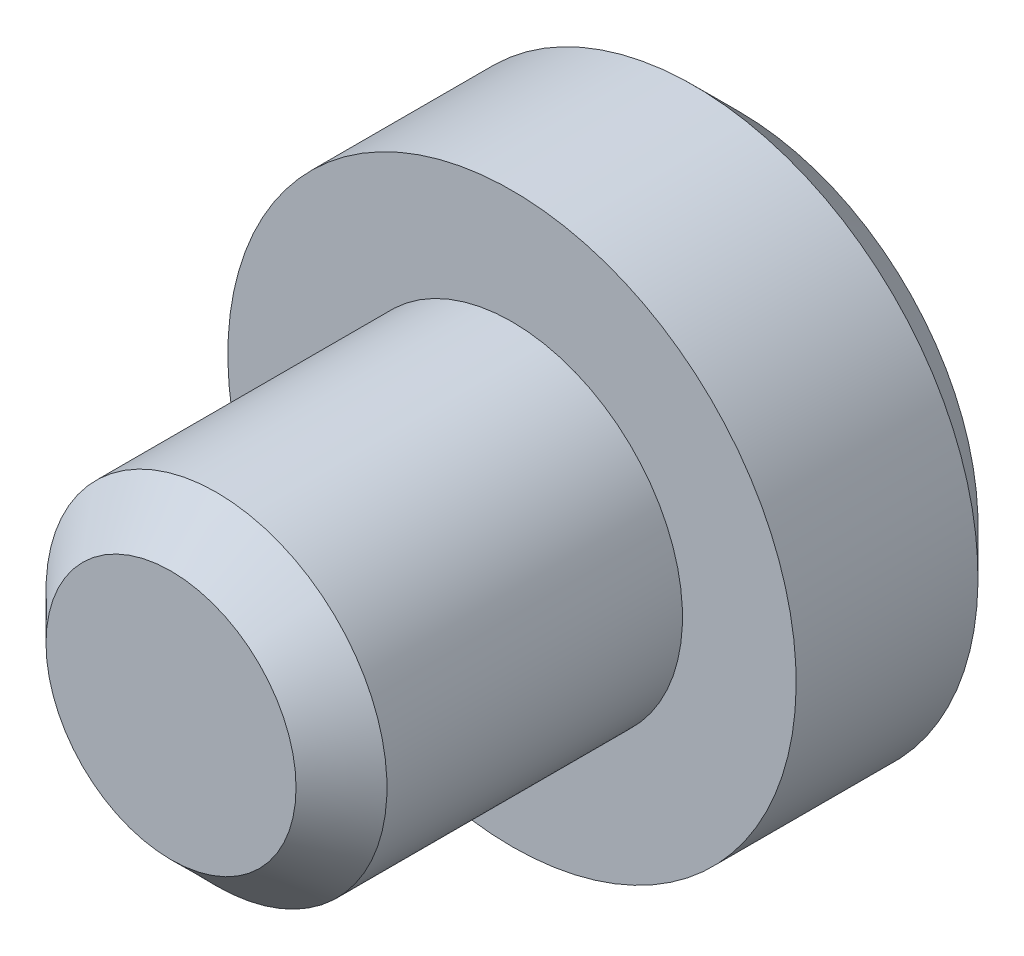
ISO-10303-21;
HEADER;
FILE_DESCRIPTION(('STEP AP214'),'2;1');
FILE_NAME('part.step','',(''),(''),'','','');
FILE_SCHEMA(('AUTOMOTIVE_DESIGN { 1 0 10303 214 1 1 1 1 }'));
ENDSEC;
DATA;
#1=APPLICATION_CONTEXT('core data for automotive mechanical design processes');
#2=APPLICATION_PROTOCOL_DEFINITION('international standard','automotive_design',2000,#1);
#3=PRODUCT_CONTEXT('',#1,'mechanical');
#4=PRODUCT('Part','Part','',(#3));
#5=PRODUCT_RELATED_PRODUCT_CATEGORY('part','',(#4));
#6=PRODUCT_DEFINITION_FORMATION('','',#4);
#7=PRODUCT_DEFINITION_CONTEXT('part definition',#1,'design');
#8=PRODUCT_DEFINITION('design','',#6,#7);
#9=PRODUCT_DEFINITION_SHAPE('','',#8);
#10=(LENGTH_UNIT() NAMED_UNIT(*) SI_UNIT(.MILLI.,.METRE.));
#11=(NAMED_UNIT(*) PLANE_ANGLE_UNIT() SI_UNIT($,.RADIAN.));
#12=(NAMED_UNIT(*) SI_UNIT($,.STERADIAN.) SOLID_ANGLE_UNIT());
#13=UNCERTAINTY_MEASURE_WITH_UNIT(LENGTH_MEASURE(1.E-05),#10,'distance_accuracy_value','');
#14=(GEOMETRIC_REPRESENTATION_CONTEXT(3) GLOBAL_UNCERTAINTY_ASSIGNED_CONTEXT((#13)) GLOBAL_UNIT_ASSIGNED_CONTEXT((#10,
#11,#12)) REPRESENTATION_CONTEXT('',''));
#15=CARTESIAN_POINT('',(0.,0.,0.));
#16=DIRECTION('',(0.,0.,1.));
#17=DIRECTION('',(1.,0.,0.));
#18=AXIS2_PLACEMENT_3D('',#15,#16,#17);
#19=CARTESIAN_POINT('',(0.,0.,0.));
#20=DIRECTION('',(0.,0.,0.999999999999999));
#21=DIRECTION('',(0.,-1.,0.));
#22=AXIS2_PLACEMENT_3D('',#19,#20,#21);
#23=PLANE('',#22);
#24=DIRECTION('',(0.799545155725773,-0.600605980619118,0.));
#25=VECTOR('',#24,1.);
#26=CARTESIAN_POINT('',(-0.720727176742916,-0.959454186870934,0.));
#27=LINE('',#26,#25);
#28=CARTESIAN_POINT('',(-1.27466830980796,-0.543342157366178,0.));
#29=VERTEX_POINT('',#28);
#30=CARTESIAN_POINT('',(-0.166786043677938,-1.37556621637569,0.));
#31=VERTEX_POINT('',#30);
#32=EDGE_CURVE('E182',#29,#31,#27,.T.);
#33=ORIENTED_EDGE('',*,*,#32,.T.);
#34=DIRECTION('',(0.919912614743907,0.392123426021746,0.));
#35=VECTOR('',#34,1.);
#36=CARTESIAN_POINT('',(0.470548111226016,-1.10389513769277,0.));
#37=LINE('',#36,#35);
#38=CARTESIAN_POINT('',(1.10788226613005,-0.832224059009568,0.));
#39=VERTEX_POINT('',#38);
#40=EDGE_CURVE('E192',#31,#39,#37,.T.);
#41=ORIENTED_EDGE('',*,*,#40,.T.);
#42=DIRECTION('',(0.120367459018134,0.992729406640863,0.));
#43=VECTOR('',#42,1.);
#44=CARTESIAN_POINT('',(1.19127528796908,-0.144440950821778,0.));
#45=LINE('',#44,#43);
#46=CARTESIAN_POINT('',(1.27466830980796,0.543342157366122,0.));
#47=VERTEX_POINT('',#46);
#48=EDGE_CURVE('E190',#39,#47,#45,.T.);
#49=ORIENTED_EDGE('',*,*,#48,.T.);
#50=DIRECTION('',(-0.799545155725773,0.600605980619118,0.));
#51=VECTOR('',#50,1.);
#52=CARTESIAN_POINT('',(0.720727176742986,0.959454186870934,0.));
#53=LINE('',#52,#51);
#54=CARTESIAN_POINT('',(0.166786043677966,1.37556621637577,0.));
#55=VERTEX_POINT('',#54);
#56=EDGE_CURVE('E188',#47,#55,#53,.T.);
#57=ORIENTED_EDGE('',*,*,#56,.T.);
#58=DIRECTION('',(-0.919912614743907,-0.392123426021745,0.));
#59=VECTOR('',#58,1.);
#60=CARTESIAN_POINT('',(-0.470548111226127,1.1038951376928,0.));
#61=LINE('',#60,#59);
#62=CARTESIAN_POINT('',(-1.10788226613005,0.832224059009623,0.));
#63=VERTEX_POINT('',#62);
#64=EDGE_CURVE('E186',#55,#63,#61,.T.);
#65=ORIENTED_EDGE('',*,*,#64,.T.);
#66=DIRECTION('',(-0.120367459018134,-0.992729406640863,0.));
#67=VECTOR('',#66,1.);
#68=CARTESIAN_POINT('',(-1.19127528796906,0.144440950821723,0.));
#69=LINE('',#68,#67);
#70=EDGE_CURVE('E184',#63,#29,#69,.T.);
#71=ORIENTED_EDGE('',*,*,#70,.T.);
#72=EDGE_LOOP('',(#33,#41,#49,#57,#65,#71));
#73=FACE_BOUND('',#72,.T.);
#74=CARTESIAN_POINT('',(0.,0.,0.));
#75=DIRECTION('',(0.,0.,0.999999999999999));
#76=DIRECTION('',(0.,-1.,0.));
#77=AXIS2_PLACEMENT_3D('',#74,#75,#76);
#78=CIRCLE('',#77,2.1);
#79=CARTESIAN_POINT('',(0.,-2.1,0.));
#80=VERTEX_POINT('',#79);
#81=EDGE_CURVE('E176',#80,#80,#78,.F.);
#82=ORIENTED_EDGE('',*,*,#81,.T.);
#83=EDGE_LOOP('',(#82));
#84=FACE_BOUND('',#83,.T.);
#85=ADVANCED_FACE('F49',(#73,#84),#23,.F.);
#86=CARTESIAN_POINT('',(0.,0.,5.));
#87=DIRECTION('',(0.,0.,0.999999999999999));
#88=DIRECTION('',(0.,-1.,0.));
#89=AXIS2_PLACEMENT_3D('',#86,#87,#88);
#90=CYLINDRICAL_SURFACE('',#89,2.5);
#91=CARTESIAN_POINT('',(0.,1.11022302462516E-13,0.399999999999998));
#92=DIRECTION('',(0.,0.,0.999999999999999));
#93=DIRECTION('',(0.,-1.,0.));
#94=AXIS2_PLACEMENT_3D('',#91,#92,#93);
#95=CIRCLE('',#94,2.5);
#96=CARTESIAN_POINT('',(0.,-2.49999999999989,0.399999999999998));
#97=VERTEX_POINT('',#96);
#98=EDGE_CURVE('E173',#97,#97,#95,.T.);
#99=ORIENTED_EDGE('',*,*,#98,.T.);
#100=EDGE_LOOP('',(#99));
#101=FACE_BOUND('',#100,.T.);
#102=CARTESIAN_POINT('',(0.,0.,2.));
#103=DIRECTION('',(0.,0.,0.999999999999999));
#104=DIRECTION('',(0.,-1.,0.));
#105=AXIS2_PLACEMENT_3D('',#102,#103,#104);
#106=CIRCLE('',#105,2.5);
#107=CARTESIAN_POINT('',(0.,-2.49999999999995,2.));
#108=VERTEX_POINT('',#107);
#109=EDGE_CURVE('E164',#108,#108,#106,.T.);
#110=ORIENTED_EDGE('',*,*,#109,.F.);
#111=EDGE_LOOP('',(#110));
#112=FACE_BOUND('',#111,.T.);
#113=ADVANCED_FACE('F260',(#101,#112),#90,.T.);
#114=CARTESIAN_POINT('',(0.,2.50000000000011,2.));
#115=DIRECTION('',(0.,0.,-0.999999999999999));
#116=DIRECTION('',(0.,1.,0.));
#117=AXIS2_PLACEMENT_3D('',#114,#115,#116);
#118=PLANE('',#117);
#119=CARTESIAN_POINT('',(0.,0.,2.));
#120=DIRECTION('',(0.,0.,0.999999999999999));
#121=DIRECTION('',(0.,-1.,0.));
#122=AXIS2_PLACEMENT_3D('',#119,#120,#121);
#123=CIRCLE('',#122,1.5);
#124=CARTESIAN_POINT('',(0.,-1.49999999999995,2.));
#125=VERTEX_POINT('',#124);
#126=EDGE_CURVE('E151',#125,#125,#123,.T.);
#127=ORIENTED_EDGE('',*,*,#126,.F.);
#128=EDGE_LOOP('',(#127));
#129=FACE_BOUND('',#128,.T.);
#130=ORIENTED_EDGE('',*,*,#109,.T.);
#131=EDGE_LOOP('',(#130));
#132=FACE_BOUND('',#131,.T.);
#133=ADVANCED_FACE('F265',(#129,#132),#118,.F.);
#134=CARTESIAN_POINT('',(0.,0.,5.));
#135=DIRECTION('',(0.,0.,0.999999999999999));
#136=DIRECTION('',(0.,-1.,0.));
#137=AXIS2_PLACEMENT_3D('',#134,#135,#136);
#138=CYLINDRICAL_SURFACE('',#137,1.5);
#139=CARTESIAN_POINT('',(0.,0.,4.59999999999999));
#140=DIRECTION('',(0.,0.,-0.999999999999999));
#141=DIRECTION('',(0.,1.,0.));
#142=AXIS2_PLACEMENT_3D('',#139,#140,#141);
#143=CIRCLE('',#142,1.5);
#144=CARTESIAN_POINT('',(0.,1.50000000000003,4.59999999999999));
#145=VERTEX_POINT('',#144);
#146=EDGE_CURVE('E170',#145,#145,#143,.T.);
#147=ORIENTED_EDGE('',*,*,#146,.T.);
#148=EDGE_LOOP('',(#147));
#149=FACE_BOUND('',#148,.T.);
#150=ORIENTED_EDGE('',*,*,#126,.T.);
#151=EDGE_LOOP('',(#150));
#152=FACE_BOUND('',#151,.T.);
#153=ADVANCED_FACE('F341',(#149,#152),#138,.T.);
#154=CARTESIAN_POINT('',(0.,1.50000000000006,4.99999999999999));
#155=DIRECTION('',(0.,0.,-0.999999999999999));
#156=DIRECTION('',(0.,1.,0.));
#157=AXIS2_PLACEMENT_3D('',#154,#155,#156);
#158=PLANE('',#157);
#159=CARTESIAN_POINT('',(0.,0.,5.));
#160=DIRECTION('',(0.,0.,-0.999999999999999));
#161=DIRECTION('',(0.,1.,0.));
#162=AXIS2_PLACEMENT_3D('',#159,#160,#161);
#163=CIRCLE('',#162,1.1);
#164=CARTESIAN_POINT('',(0.,1.10000000000006,5.));
#165=VERTEX_POINT('',#164);
#166=EDGE_CURVE('E167',#165,#165,#163,.F.);
#167=ORIENTED_EDGE('',*,*,#166,.T.);
#168=EDGE_LOOP('',(#167));
#169=FACE_BOUND('',#168,.T.);
#170=ADVANCED_FACE('F334',(#169),#158,.F.);
#171=CARTESIAN_POINT('',(-0.152887206704699,-1.26093569834435,2.00000000000006));
#172=DIRECTION('',(-0.600605980619119,-0.799545155725773,0.));
#173=DIRECTION('',(0.799545155725773,-0.600605980619119,0.));
#174=AXIS2_PLACEMENT_3D('',#171,#172,#173);
#175=PLANE('',#174);
#176=DIRECTION('',(0.,0.,-0.999999999999999));
#177=VECTOR('',#176,1.);
#178=CARTESIAN_POINT('',(-0.152887206704699,-1.26093569834435,2.00000000000006));
#179=LINE('',#178,#177);
#180=CARTESIAN_POINT('',(-0.152887206704699,-1.26093569834435,2.00000000000006));
#181=VERTEX_POINT('',#180);
#182=CARTESIAN_POINT('',(-0.152887206704616,-1.26093569834435,0.100000000000058));
#183=VERTEX_POINT('',#182);
#184=EDGE_CURVE('E149',#181,#183,#179,.T.);
#185=ORIENTED_EDGE('',*,*,#184,.T.);
#186=DIRECTION('',(-0.799545155725773,0.600605980619119,0.));
#187=VECTOR('',#186,1.);
#188=CARTESIAN_POINT('',(-0.152887206704616,-1.26093569834435,0.100000000000058));
#189=LINE('',#188,#187);
#190=CARTESIAN_POINT('',(-1.16844595065732,-0.498063644252228,0.0999999999999751));
#191=VERTEX_POINT('',#190);
#192=EDGE_CURVE('E13',#183,#191,#189,.T.);
#193=ORIENTED_EDGE('',*,*,#192,.T.);
#194=DIRECTION('',(0.,0.,-0.999999999999999));
#195=VECTOR('',#194,1.);
#196=CARTESIAN_POINT('',(-1.16844595065724,-0.4980636442522,1.99999999999997));
#197=LINE('',#196,#195);
#198=CARTESIAN_POINT('',(-1.16844595065724,-0.4980636442522,1.99999999999997));
#199=VERTEX_POINT('',#198);
#200=EDGE_CURVE('E118',#199,#191,#197,.T.);
#201=ORIENTED_EDGE('',*,*,#200,.F.);
#202=DIRECTION('',(-0.799545155725773,0.600605980619119,0.));
#203=VECTOR('',#202,1.);
#204=CARTESIAN_POINT('',(-0.152887206704699,-1.26093569834435,2.00000000000006));
#205=LINE('',#204,#203);
#206=EDGE_CURVE('E122',#181,#199,#205,.T.);
#207=ORIENTED_EDGE('',*,*,#206,.F.);
#208=EDGE_LOOP('',(#185,#193,#201,#207));
#209=FACE_BOUND('',#208,.T.);
#210=ADVANCED_FACE('F120',(#209),#175,.F.);
#211=CARTESIAN_POINT('',(1.01555874395254,-0.762872054092201,1.99999999999997));
#212=DIRECTION('',(0.392123426021745,-0.919912614743907,0.));
#213=DIRECTION('',(0.919912614743907,0.392123426021746,0.));
#214=AXIS2_PLACEMENT_3D('',#211,#212,#213);
#215=PLANE('',#214);
#216=DIRECTION('',(0.,0.,-0.999999999999999));
#217=VECTOR('',#216,1.);
#218=CARTESIAN_POINT('',(1.01555874395254,-0.762872054092201,1.99999999999997));
#219=LINE('',#218,#217);
#220=CARTESIAN_POINT('',(1.01555874395254,-0.762872054092201,1.99999999999997));
#221=VERTEX_POINT('',#220);
#222=CARTESIAN_POINT('',(1.01555874395252,-0.762872054092117,0.099999999999989));
#223=VERTEX_POINT('',#222);
#224=EDGE_CURVE('E152',#221,#223,#219,.T.);
#225=ORIENTED_EDGE('',*,*,#224,.T.);
#226=DIRECTION('',(-0.919912614743907,-0.392123426021746,0.));
#227=VECTOR('',#226,1.);
#228=CARTESIAN_POINT('',(1.01555874395252,-0.762872054092117,0.099999999999989));
#229=LINE('',#228,#227);
#230=EDGE_CURVE('E179',#223,#183,#229,.T.);
#231=ORIENTED_EDGE('',*,*,#230,.T.);
#232=ORIENTED_EDGE('',*,*,#184,.F.);
#233=DIRECTION('',(-0.919912614743907,-0.392123426021745,0.));
#234=VECTOR('',#233,1.);
#235=CARTESIAN_POINT('',(1.01555874395254,-0.762872054092201,1.99999999999997));
#236=LINE('',#235,#234);
#237=EDGE_CURVE('E125',#221,#181,#236,.T.);
#238=ORIENTED_EDGE('',*,*,#237,.F.);
#239=EDGE_LOOP('',(#225,#231,#232,#238));
#240=FACE_BOUND('',#239,.T.);
#241=ADVANCED_FACE('F230',(#240),#215,.F.);
#242=CARTESIAN_POINT('',(1.16844595065728,0.498063644252367,1.99999999999999));
#243=DIRECTION('',(0.992729406640863,-0.120367459018134,0.));
#244=DIRECTION('',(0.120367459018134,0.992729406640863,0.));
#245=AXIS2_PLACEMENT_3D('',#242,#243,#244);
#246=PLANE('',#245);
#247=DIRECTION('',(0.,0.,-0.999999999999999));
#248=VECTOR('',#247,1.);
#249=CARTESIAN_POINT('',(1.16844595065728,0.498063644252367,1.99999999999999));
#250=LINE('',#249,#248);
#251=CARTESIAN_POINT('',(1.16844595065728,0.498063644252367,1.99999999999999));
#252=VERTEX_POINT('',#251);
#253=CARTESIAN_POINT('',(1.16844595065733,0.498063644252256,0.0999999999999751));
#254=VERTEX_POINT('',#253);
#255=EDGE_CURVE('E155',#252,#254,#250,.T.);
#256=ORIENTED_EDGE('',*,*,#255,.T.);
#257=DIRECTION('',(-0.120367459018134,-0.992729406640863,0.));
#258=VECTOR('',#257,1.);
#259=CARTESIAN_POINT('',(1.16844595065733,0.498063644252256,0.0999999999999751));
#260=LINE('',#259,#258);
#261=EDGE_CURVE('E195',#254,#223,#260,.T.);
#262=ORIENTED_EDGE('',*,*,#261,.T.);
#263=ORIENTED_EDGE('',*,*,#224,.F.);
#264=DIRECTION('',(-0.120367459018134,-0.992729406640863,0.));
#265=VECTOR('',#264,1.);
#266=CARTESIAN_POINT('',(1.16844595065728,0.498063644252367,1.99999999999999));
#267=LINE('',#266,#265);
#268=EDGE_CURVE('E146',#252,#221,#267,.T.);
#269=ORIENTED_EDGE('',*,*,#268,.F.);
#270=EDGE_LOOP('',(#256,#262,#263,#269));
#271=FACE_BOUND('',#270,.T.);
#272=ADVANCED_FACE('F250',(#271),#246,.F.);
#273=CARTESIAN_POINT('',(0.152887206704685,1.26093569834451,1.99999999999999));
#274=DIRECTION('',(0.600605980619119,0.799545155725773,0.));
#275=DIRECTION('',(-0.799545155725773,0.600605980619119,0.));
#276=AXIS2_PLACEMENT_3D('',#273,#274,#275);
#277=PLANE('',#276);
#278=DIRECTION('',(0.,0.,-0.999999999999999));
#279=VECTOR('',#278,1.);
#280=CARTESIAN_POINT('',(0.152887206704685,1.26093569834451,1.99999999999999));
#281=LINE('',#280,#279);
#282=CARTESIAN_POINT('',(0.152887206704685,1.26093569834451,1.99999999999999));
#283=VERTEX_POINT('',#282);
#284=CARTESIAN_POINT('',(0.152887206704713,1.26093569834457,0.099999999999989));
#285=VERTEX_POINT('',#284);
#286=EDGE_CURVE('E158',#283,#285,#281,.T.);
#287=ORIENTED_EDGE('',*,*,#286,.T.);
#288=DIRECTION('',(0.799545155725773,-0.600605980619119,0.));
#289=VECTOR('',#288,1.);
#290=CARTESIAN_POINT('',(0.152887206704713,1.26093569834457,0.099999999999989));
#291=LINE('',#290,#289);
#292=EDGE_CURVE('E197',#285,#254,#291,.T.);
#293=ORIENTED_EDGE('',*,*,#292,.T.);
#294=ORIENTED_EDGE('',*,*,#255,.F.);
#295=DIRECTION('',(0.799545155725773,-0.600605980619119,0.));
#296=VECTOR('',#295,1.);
#297=CARTESIAN_POINT('',(0.152887206704685,1.26093569834451,1.99999999999999));
#298=LINE('',#297,#296);
#299=EDGE_CURVE('E143',#283,#252,#298,.T.);
#300=ORIENTED_EDGE('',*,*,#299,.F.);
#301=EDGE_LOOP('',(#287,#293,#294,#300));
#302=FACE_BOUND('',#301,.T.);
#303=ADVANCED_FACE('F226',(#302),#277,.F.);
#304=CARTESIAN_POINT('',(-1.01555874395257,0.762872054092256,1.99999999999997));
#305=DIRECTION('',(-0.392123426021745,0.919912614743907,0.));
#306=DIRECTION('',(-0.919912614743907,-0.392123426021745,0.));
#307=AXIS2_PLACEMENT_3D('',#304,#305,#306);
#308=PLANE('',#307);
#309=DIRECTION('',(0.,0.,-0.999999999999999));
#310=VECTOR('',#309,1.);
#311=CARTESIAN_POINT('',(-1.01555874395257,0.762872054092256,1.99999999999997));
#312=LINE('',#311,#310);
#313=CARTESIAN_POINT('',(-1.01555874395257,0.762872054092256,1.99999999999997));
#314=VERTEX_POINT('',#313);
#315=CARTESIAN_POINT('',(-1.01555874395255,0.762872054092284,0.0999999999999751));
#316=VERTEX_POINT('',#315);
#317=EDGE_CURVE('E124',#314,#316,#312,.T.);
#318=ORIENTED_EDGE('',*,*,#317,.T.);
#319=DIRECTION('',(0.919912614743907,0.392123426021745,0.));
#320=VECTOR('',#319,1.);
#321=CARTESIAN_POINT('',(-1.01555874395255,0.762872054092284,0.0999999999999751));
#322=LINE('',#321,#320);
#323=EDGE_CURVE('E199',#316,#285,#322,.T.);
#324=ORIENTED_EDGE('',*,*,#323,.T.);
#325=ORIENTED_EDGE('',*,*,#286,.F.);
#326=DIRECTION('',(0.919912614743907,0.392123426021746,0.));
#327=VECTOR('',#326,1.);
#328=CARTESIAN_POINT('',(-1.01555874395257,0.762872054092256,1.99999999999997));
#329=LINE('',#328,#327);
#330=EDGE_CURVE('E133',#314,#283,#329,.T.);
#331=ORIENTED_EDGE('',*,*,#330,.F.);
#332=EDGE_LOOP('',(#318,#324,#325,#331));
#333=FACE_BOUND('',#332,.T.);
#334=ADVANCED_FACE('F223',(#333),#308,.F.);
#335=CARTESIAN_POINT('',(-1.16844595065724,-0.4980636442522,1.99999999999997));
#336=DIRECTION('',(-0.992729406640863,0.120367459018134,0.));
#337=DIRECTION('',(-0.120367459018134,-0.992729406640863,0.));
#338=AXIS2_PLACEMENT_3D('',#335,#336,#337);
#339=PLANE('',#338);
#340=ORIENTED_EDGE('',*,*,#200,.T.);
#341=DIRECTION('',(0.120367459018134,0.992729406640863,0.));
#342=VECTOR('',#341,1.);
#343=CARTESIAN_POINT('',(-1.16844595065732,-0.498063644252228,0.0999999999999751));
#344=LINE('',#343,#342);
#345=EDGE_CURVE('E58',#191,#316,#344,.T.);
#346=ORIENTED_EDGE('',*,*,#345,.T.);
#347=ORIENTED_EDGE('',*,*,#317,.F.);
#348=DIRECTION('',(0.120367459018134,0.992729406640863,0.));
#349=VECTOR('',#348,1.);
#350=CARTESIAN_POINT('',(-1.16844595065724,-0.4980636442522,1.99999999999997));
#351=LINE('',#350,#349);
#352=EDGE_CURVE('E128',#199,#314,#351,.T.);
#353=ORIENTED_EDGE('',*,*,#352,.F.);
#354=EDGE_LOOP('',(#340,#346,#347,#353));
#355=FACE_BOUND('',#354,.T.);
#356=ADVANCED_FACE('F129',(#355),#339,.F.);
#357=CARTESIAN_POINT('',(0.,0.,2.));
#358=DIRECTION('',(0.,0.,-0.999999999999999));
#359=DIRECTION('',(0.,1.,0.));
#360=AXIS2_PLACEMENT_3D('',#357,#358,#359);
#361=PLANE('',#360);
#362=ORIENTED_EDGE('',*,*,#206,.T.);
#363=ORIENTED_EDGE('',*,*,#352,.T.);
#364=ORIENTED_EDGE('',*,*,#330,.T.);
#365=ORIENTED_EDGE('',*,*,#299,.T.);
#366=ORIENTED_EDGE('',*,*,#268,.T.);
#367=ORIENTED_EDGE('',*,*,#237,.T.);
#368=EDGE_LOOP('',(#362,#363,#364,#365,#366,#367));
#369=FACE_BOUND('',#368,.T.);
#370=ADVANCED_FACE('F135',(#369),#361,.T.);
#371=CARTESIAN_POINT('',(0.,0.,5.));
#372=DIRECTION('',(0.,0.,-0.999999999999999));
#373=DIRECTION('',(0.,1.,0.));
#374=AXIS2_PLACEMENT_3D('',#371,#372,#373);
#375=CONICAL_SURFACE('',#374,1.1,0.785398163397447);
#376=ORIENTED_EDGE('',*,*,#146,.F.);
#377=EDGE_LOOP('',(#376));
#378=FACE_BOUND('',#377,.T.);
#379=ORIENTED_EDGE('',*,*,#166,.F.);
#380=EDGE_LOOP('',(#379));
#381=FACE_BOUND('',#380,.T.);
#382=ADVANCED_FACE('F270',(#378,#381),#375,.T.);
#383=CARTESIAN_POINT('',(0.,1.11022302462516E-13,0.399999999999998));
#384=DIRECTION('',(0.,0.,0.999999999999999));
#385=DIRECTION('',(0.,-1.,0.));
#386=AXIS2_PLACEMENT_3D('',#383,#384,#385);
#387=CONICAL_SURFACE('',#386,2.5,0.78539816339745);
#388=ORIENTED_EDGE('',*,*,#81,.F.);
#389=EDGE_LOOP('',(#388));
#390=FACE_BOUND('',#389,.T.);
#391=ORIENTED_EDGE('',*,*,#98,.F.);
#392=EDGE_LOOP('',(#391));
#393=FACE_BOUND('',#392,.T.);
#394=ADVANCED_FACE('F273',(#390,#393),#387,.T.);
#395=CARTESIAN_POINT('',(-1.01555874395255,0.762872054092284,0.0999999999999751));
#396=DIRECTION('',(-0.277273133602077,0.650476447984464,0.707106781186547));
#397=DIRECTION('',(0.919912614743907,0.392123426021745,0.));
#398=AXIS2_PLACEMENT_3D('',#395,#396,#397);
#399=PLANE('',#398);
#400=DIRECTION('',(0.604399326861943,-0.454015445901792,0.654653670707976));
#401=VECTOR('',#400,1.);
#402=CARTESIAN_POINT('',(-1.01555874395255,0.762872054092284,0.0999999999999751));
#403=LINE('',#402,#401);
#404=EDGE_CURVE('E140',#63,#316,#403,.T.);
#405=ORIENTED_EDGE('',*,*,#404,.F.);
#406=ORIENTED_EDGE('',*,*,#64,.F.);
#407=DIRECTION('',(-0.0909892464304953,-0.750432894043553,0.654653670707976));
#408=VECTOR('',#407,1.);
#409=CARTESIAN_POINT('',(0.152887206704713,1.26093569834457,0.099999999999989));
#410=LINE('',#409,#408);
#411=EDGE_CURVE('E53',#285,#55,#410,.F.);
#412=ORIENTED_EDGE('',*,*,#411,.F.);
#413=ORIENTED_EDGE('',*,*,#323,.F.);
#414=EDGE_LOOP('',(#405,#406,#412,#413));
#415=FACE_BOUND('',#414,.T.);
#416=ADVANCED_FACE('F51',(#415),#399,.F.);
#417=CARTESIAN_POINT('',(0.152887206704713,1.26093569834457,0.099999999999989));
#418=DIRECTION('',(0.424692561716975,0.565363801478548,0.707106781186546));
#419=DIRECTION('',(0.799545155725773,-0.600605980619119,0.));
#420=AXIS2_PLACEMENT_3D('',#417,#418,#419);
#421=PLANE('',#420);
#422=ORIENTED_EDGE('',*,*,#411,.T.);
#423=ORIENTED_EDGE('',*,*,#56,.F.);
#424=DIRECTION('',(-0.695388573292442,-0.296417448141762,0.654653670707976));
#425=VECTOR('',#424,1.);
#426=CARTESIAN_POINT('',(1.16844595065733,0.498063644252256,0.0999999999999751));
#427=LINE('',#426,#425);
#428=EDGE_CURVE('E209',#254,#47,#427,.F.);
#429=ORIENTED_EDGE('',*,*,#428,.F.);
#430=ORIENTED_EDGE('',*,*,#292,.F.);
#431=EDGE_LOOP('',(#422,#423,#429,#430));
#432=FACE_BOUND('',#431,.T.);
#433=ADVANCED_FACE('F246',(#432),#421,.F.);
#434=CARTESIAN_POINT('',(-1.16844595065732,-0.498063644252228,0.0999999999999751));
#435=DIRECTION('',(-0.701965695319053,0.0851126465059164,0.707106781186546));
#436=DIRECTION('',(0.120367459018134,0.992729406640863,0.));
#437=AXIS2_PLACEMENT_3D('',#434,#435,#436);
#438=PLANE('',#437);
#439=ORIENTED_EDGE('',*,*,#404,.T.);
#440=ORIENTED_EDGE('',*,*,#345,.F.);
#441=DIRECTION('',(0.695388573292441,0.296417448141765,0.654653670707976));
#442=VECTOR('',#441,1.);
#443=CARTESIAN_POINT('',(-1.16844595065732,-0.498063644252228,0.0999999999999751));
#444=LINE('',#443,#442);
#445=EDGE_CURVE('E206',#29,#191,#444,.T.);
#446=ORIENTED_EDGE('',*,*,#445,.F.);
#447=ORIENTED_EDGE('',*,*,#70,.F.);
#448=EDGE_LOOP('',(#439,#440,#446,#447));
#449=FACE_BOUND('',#448,.T.);
#450=ADVANCED_FACE('F215',(#449),#438,.F.);
#451=CARTESIAN_POINT('',(1.16844595065733,0.498063644252256,0.0999999999999751));
#452=DIRECTION('',(0.701965695319052,-0.0851126465059167,0.707106781186546));
#453=DIRECTION('',(-0.120367459018134,-0.992729406640863,0.));
#454=AXIS2_PLACEMENT_3D('',#451,#452,#453);
#455=PLANE('',#454);
#456=ORIENTED_EDGE('',*,*,#428,.T.);
#457=ORIENTED_EDGE('',*,*,#48,.F.);
#458=DIRECTION('',(-0.604399326861943,0.454015445901793,0.654653670707975));
#459=VECTOR('',#458,1.);
#460=CARTESIAN_POINT('',(1.01555874395252,-0.762872054092117,0.099999999999989));
#461=LINE('',#460,#459);
#462=EDGE_CURVE('E204',#223,#39,#461,.F.);
#463=ORIENTED_EDGE('',*,*,#462,.F.);
#464=ORIENTED_EDGE('',*,*,#261,.F.);
#465=EDGE_LOOP('',(#456,#457,#463,#464));
#466=FACE_BOUND('',#465,.T.);
#467=ADVANCED_FACE('F249',(#466),#455,.F.);
#468=CARTESIAN_POINT('',(-0.152887206704616,-1.26093569834435,0.100000000000058));
#469=DIRECTION('',(-0.424692561716974,-0.565363801478548,0.707106781186546));
#470=DIRECTION('',(-0.799545155725773,0.600605980619119,0.));
#471=AXIS2_PLACEMENT_3D('',#468,#469,#470);
#472=PLANE('',#471);
#473=ORIENTED_EDGE('',*,*,#445,.T.);
#474=ORIENTED_EDGE('',*,*,#192,.F.);
#475=DIRECTION('',(-0.090989246430496,-0.750432894043555,-0.654653670707975));
#476=VECTOR('',#475,1.);
#477=CARTESIAN_POINT('',(-0.109205147646202,-0.900668355960199,0.414285714285714));
#478=LINE('',#477,#476);
#479=EDGE_CURVE('E202',#31,#183,#478,.F.);
#480=ORIENTED_EDGE('',*,*,#479,.F.);
#481=ORIENTED_EDGE('',*,*,#32,.F.);
#482=EDGE_LOOP('',(#473,#474,#480,#481));
#483=FACE_BOUND('',#482,.T.);
#484=ADVANCED_FACE('F240',(#483),#472,.F.);
#485=CARTESIAN_POINT('',(1.01555874395252,-0.762872054092117,0.099999999999989));
#486=DIRECTION('',(0.277273133602077,-0.650476447984463,0.707106781186548));
#487=DIRECTION('',(-0.919912614743907,-0.392123426021746,0.));
#488=AXIS2_PLACEMENT_3D('',#485,#486,#487);
#489=PLANE('',#488);
#490=ORIENTED_EDGE('',*,*,#462,.T.);
#491=ORIENTED_EDGE('',*,*,#40,.F.);
#492=ORIENTED_EDGE('',*,*,#479,.T.);
#493=ORIENTED_EDGE('',*,*,#230,.F.);
#494=EDGE_LOOP('',(#490,#491,#492,#493));
#495=FACE_BOUND('',#494,.T.);
#496=ADVANCED_FACE('F234',(#495),#489,.F.);
#497=CLOSED_SHELL('',(#85,#113,#133,#153,#170,#210,#241,#272,#303,#334,#356,#370,#382,#394,#416,
#433,#450,#467,#484,#496));
#498=MANIFOLD_SOLID_BREP('B2',#497);
#499=ADVANCED_BREP_SHAPE_REPRESENTATION('',(#18,#498),#14);
#500=SHAPE_DEFINITION_REPRESENTATION(#9,#499);
ENDSEC;
END-ISO-10303-21;
